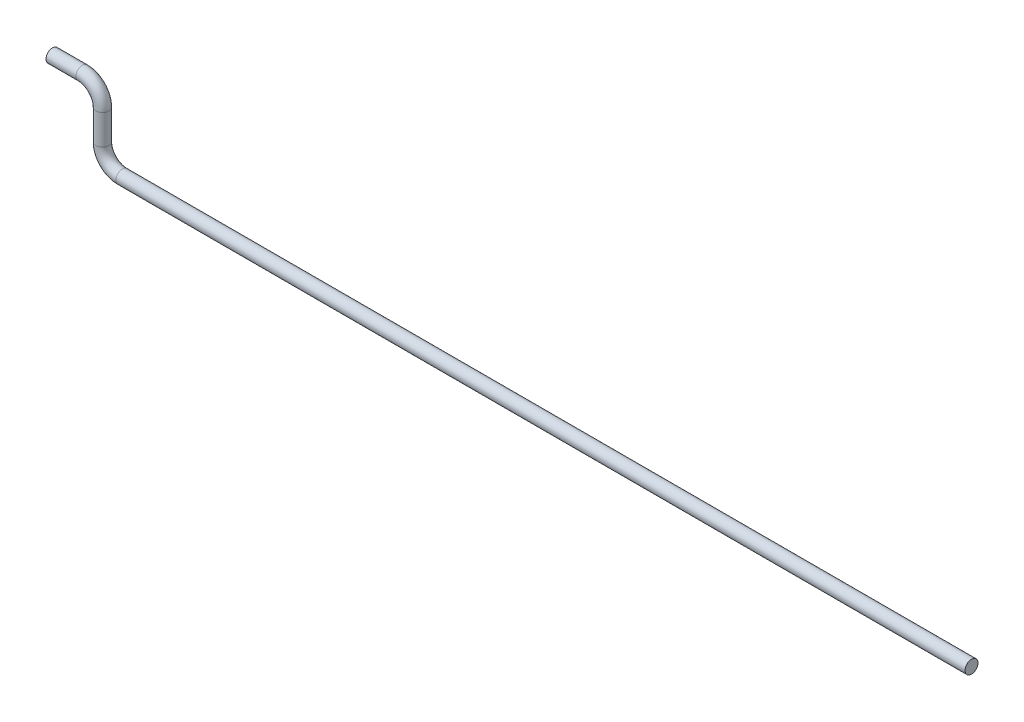
ISO-10303-21;
HEADER;
FILE_DESCRIPTION(('STEP AP214'),'2;1');
FILE_NAME('part.step','',(''),(''),'','','');
FILE_SCHEMA(('AUTOMOTIVE_DESIGN { 1 0 10303 214 1 1 1 1 }'));
ENDSEC;
DATA;
#1=APPLICATION_CONTEXT('core data for automotive mechanical design processes');
#2=APPLICATION_PROTOCOL_DEFINITION('international standard','automotive_design',2000,#1);
#3=PRODUCT_CONTEXT('',#1,'mechanical');
#4=PRODUCT('Part','Part','',(#3));
#5=PRODUCT_RELATED_PRODUCT_CATEGORY('part','',(#4));
#6=PRODUCT_DEFINITION_FORMATION('','',#4);
#7=PRODUCT_DEFINITION_CONTEXT('part definition',#1,'design');
#8=PRODUCT_DEFINITION('design','',#6,#7);
#9=PRODUCT_DEFINITION_SHAPE('','',#8);
#10=(LENGTH_UNIT() NAMED_UNIT(*) SI_UNIT(.MILLI.,.METRE.));
#11=(NAMED_UNIT(*) PLANE_ANGLE_UNIT() SI_UNIT($,.RADIAN.));
#12=(NAMED_UNIT(*) SI_UNIT($,.STERADIAN.) SOLID_ANGLE_UNIT());
#13=UNCERTAINTY_MEASURE_WITH_UNIT(LENGTH_MEASURE(1.E-05),#10,'distance_accuracy_value','');
#14=(GEOMETRIC_REPRESENTATION_CONTEXT(3) GLOBAL_UNCERTAINTY_ASSIGNED_CONTEXT((#13)) GLOBAL_UNIT_ASSIGNED_CONTEXT((#10,
#11,#12)) REPRESENTATION_CONTEXT('',''));
#15=CARTESIAN_POINT('',(0.,0.,0.));
#16=DIRECTION('',(0.,0.,1.));
#17=DIRECTION('',(1.,0.,0.));
#18=AXIS2_PLACEMENT_3D('',#15,#16,#17);
#19=CARTESIAN_POINT('',(-7.00000000000001,7.,0.));
#20=DIRECTION('',(1.,0.,0.));
#21=DIRECTION('',(0.,0.,-1.));
#22=AXIS2_PLACEMENT_3D('',#19,#20,#21);
#23=PLANE('',#22);
#24=CARTESIAN_POINT('',(-7.00000000000001,7.,0.));
#25=DIRECTION('',(1.,0.,0.));
#26=DIRECTION('',(0.,0.,-1.));
#27=AXIS2_PLACEMENT_3D('',#24,#25,#26);
#28=CIRCLE('',#27,0.65);
#29=CARTESIAN_POINT('',(-7.00000000000001,7.,-0.65));
#30=VERTEX_POINT('',#29);
#31=EDGE_CURVE('E66',#30,#30,#28,.T.);
#32=ORIENTED_EDGE('',*,*,#31,.F.);
#33=EDGE_LOOP('',(#32));
#34=FACE_BOUND('',#33,.T.);
#35=ADVANCED_FACE('F39',(#34),#23,.F.);
#36=CARTESIAN_POINT('',(85.,0.,0.));
#37=DIRECTION('',(1.,0.,0.));
#38=DIRECTION('',(0.,0.,-1.));
#39=AXIS2_PLACEMENT_3D('',#36,#37,#38);
#40=PLANE('',#39);
#41=CARTESIAN_POINT('',(85.,0.,0.));
#42=DIRECTION('',(1.,0.,0.));
#43=DIRECTION('',(0.,0.,-1.));
#44=AXIS2_PLACEMENT_3D('',#41,#42,#43);
#45=CIRCLE('',#44,0.65);
#46=CARTESIAN_POINT('',(85.,0.,-0.65));
#47=VERTEX_POINT('',#46);
#48=EDGE_CURVE('E10',#47,#47,#45,.T.);
#49=ORIENTED_EDGE('',*,*,#48,.T.);
#50=EDGE_LOOP('',(#49));
#51=FACE_BOUND('',#50,.T.);
#52=ADVANCED_FACE('F74',(#51),#40,.T.);
#53=CARTESIAN_POINT('',(-7.00000000000001,7.,0.));
#54=DIRECTION('',(1.,0.,0.));
#55=DIRECTION('',(0.,0.,-1.));
#56=AXIS2_PLACEMENT_3D('',#53,#54,#55);
#57=CYLINDRICAL_SURFACE('',#56,0.65);
#58=CARTESIAN_POINT('',(-4.,7.,0.));
#59=DIRECTION('',(1.,0.,0.));
#60=DIRECTION('',(0.,0.,-1.));
#61=AXIS2_PLACEMENT_3D('',#58,#59,#60);
#62=CIRCLE('',#61,0.65);
#63=CARTESIAN_POINT('',(-4.,7.65,0.));
#64=VERTEX_POINT('',#63);
#65=EDGE_CURVE('E62',#64,#64,#62,.T.);
#66=ORIENTED_EDGE('',*,*,#65,.F.);
#67=EDGE_LOOP('',(#66));
#68=FACE_BOUND('',#67,.T.);
#69=ORIENTED_EDGE('',*,*,#31,.T.);
#70=EDGE_LOOP('',(#69));
#71=FACE_BOUND('',#70,.T.);
#72=ADVANCED_FACE('F71',(#68,#71),#57,.T.);
#73=CARTESIAN_POINT('',(-4.,5.,0.));
#74=DIRECTION('',(0.,0.,-1.));
#75=DIRECTION('',(-1.,0.,0.));
#76=AXIS2_PLACEMENT_3D('',#73,#74,#75);
#77=TOROIDAL_SURFACE('',#76,2.,0.65);
#78=CARTESIAN_POINT('',(-2.,5.,0.));
#79=DIRECTION('',(0.,-1.,0.));
#80=DIRECTION('',(0.,0.,-1.));
#81=AXIS2_PLACEMENT_3D('',#78,#79,#80);
#82=CIRCLE('',#81,0.65);
#83=CARTESIAN_POINT('',(-1.35,5.00000000000001,0.));
#84=VERTEX_POINT('',#83);
#85=EDGE_CURVE('E56',#84,#84,#82,.T.);
#86=CARTESIAN_POINT('',(-4.,5.,0.));
#87=DIRECTION('',(0.,0.,-1.));
#88=DIRECTION('',(-1.,0.,0.));
#89=AXIS2_PLACEMENT_3D('',#86,#87,#88);
#90=CIRCLE('',#89,2.65);
#91=EDGE_CURVE('',#64,#84,#90,.T.);
#92=ORIENTED_EDGE('',*,*,#65,.T.);
#93=ORIENTED_EDGE('',*,*,#85,.F.);
#94=ORIENTED_EDGE('',*,*,#91,.T.);
#95=ORIENTED_EDGE('',*,*,#91,.F.);
#96=EDGE_LOOP('',(#92,#94,#93,#95));
#97=FACE_BOUND('',#96,.T.);
#98=ADVANCED_FACE('F92',(#97),#77,.T.);
#99=CARTESIAN_POINT('',(-2.,5.,0.));
#100=DIRECTION('',(0.,-1.,0.));
#101=DIRECTION('',(0.,0.,-1.));
#102=AXIS2_PLACEMENT_3D('',#99,#100,#101);
#103=CYLINDRICAL_SURFACE('',#102,0.65);
#104=CARTESIAN_POINT('',(-2.,2.,0.));
#105=DIRECTION('',(0.,-1.,0.));
#106=DIRECTION('',(0.,0.,-1.));
#107=AXIS2_PLACEMENT_3D('',#104,#105,#106);
#108=CIRCLE('',#107,0.65);
#109=CARTESIAN_POINT('',(-2.65,2.,0.));
#110=VERTEX_POINT('',#109);
#111=EDGE_CURVE('E51',#110,#110,#108,.T.);
#112=ORIENTED_EDGE('',*,*,#111,.F.);
#113=EDGE_LOOP('',(#112));
#114=FACE_BOUND('',#113,.T.);
#115=ORIENTED_EDGE('',*,*,#85,.T.);
#116=EDGE_LOOP('',(#115));
#117=FACE_BOUND('',#116,.T.);
#118=ADVANCED_FACE('F86',(#114,#117),#103,.T.);
#119=CARTESIAN_POINT('',(0.,2.,0.));
#120=DIRECTION('',(0.,0.,1.));
#121=DIRECTION('',(1.,0.,0.));
#122=AXIS2_PLACEMENT_3D('',#119,#120,#121);
#123=TOROIDAL_SURFACE('',#122,2.,0.65);
#124=CARTESIAN_POINT('',(0.,0.,0.));
#125=DIRECTION('',(1.,0.,0.));
#126=DIRECTION('',(0.,0.,-1.));
#127=AXIS2_PLACEMENT_3D('',#124,#125,#126);
#128=CIRCLE('',#127,0.65);
#129=CARTESIAN_POINT('',(0.,-0.65,0.));
#130=VERTEX_POINT('',#129);
#131=EDGE_CURVE('E46',#130,#130,#128,.T.);
#132=CARTESIAN_POINT('',(0.,2.,0.));
#133=DIRECTION('',(0.,0.,1.));
#134=DIRECTION('',(1.,0.,0.));
#135=AXIS2_PLACEMENT_3D('',#132,#133,#134);
#136=CIRCLE('',#135,2.65);
#137=EDGE_CURVE('',#110,#130,#136,.T.);
#138=ORIENTED_EDGE('',*,*,#111,.T.);
#139=ORIENTED_EDGE('',*,*,#131,.F.);
#140=ORIENTED_EDGE('',*,*,#137,.T.);
#141=ORIENTED_EDGE('',*,*,#137,.F.);
#142=EDGE_LOOP('',(#138,#140,#139,#141));
#143=FACE_BOUND('',#142,.T.);
#144=ADVANCED_FACE('F80',(#143),#123,.T.);
#145=CARTESIAN_POINT('',(0.,0.,0.));
#146=DIRECTION('',(1.,0.,0.));
#147=DIRECTION('',(0.,0.,-1.));
#148=AXIS2_PLACEMENT_3D('',#145,#146,#147);
#149=CYLINDRICAL_SURFACE('',#148,0.65);
#150=ORIENTED_EDGE('',*,*,#48,.F.);
#151=EDGE_LOOP('',(#150));
#152=FACE_BOUND('',#151,.T.);
#153=ORIENTED_EDGE('',*,*,#131,.T.);
#154=EDGE_LOOP('',(#153));
#155=FACE_BOUND('',#154,.T.);
#156=ADVANCED_FACE('F78',(#152,#155),#149,.T.);
#157=CLOSED_SHELL('',(#35,#52,#72,#98,#118,#144,#156));
#158=MANIFOLD_SOLID_BREP('B2',#157);
#159=ADVANCED_BREP_SHAPE_REPRESENTATION('',(#18,#158),#14);
#160=SHAPE_DEFINITION_REPRESENTATION(#9,#159);
ENDSEC;
END-ISO-10303-21;
